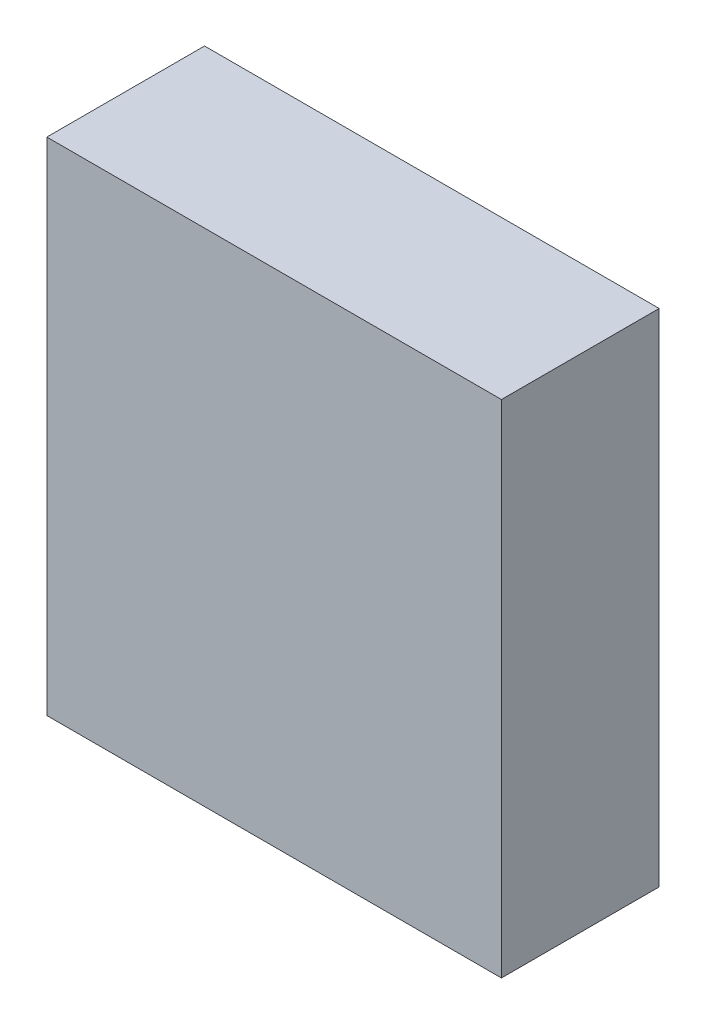
ISO-10303-21;
HEADER;
FILE_DESCRIPTION(('STEP AP214'),'2;1');
FILE_NAME('part.step','',(''),(''),'','','');
FILE_SCHEMA(('AUTOMOTIVE_DESIGN { 1 0 10303 214 1 1 1 1 }'));
ENDSEC;
DATA;
#1=APPLICATION_CONTEXT('core data for automotive mechanical design processes');
#2=APPLICATION_PROTOCOL_DEFINITION('international standard','automotive_design',2000,#1);
#3=PRODUCT_CONTEXT('',#1,'mechanical');
#4=PRODUCT('Part','Part','',(#3));
#5=PRODUCT_RELATED_PRODUCT_CATEGORY('part','',(#4));
#6=PRODUCT_DEFINITION_FORMATION('','',#4);
#7=PRODUCT_DEFINITION_CONTEXT('part definition',#1,'design');
#8=PRODUCT_DEFINITION('design','',#6,#7);
#9=PRODUCT_DEFINITION_SHAPE('','',#8);
#10=(LENGTH_UNIT() NAMED_UNIT(*) SI_UNIT(.MILLI.,.METRE.));
#11=(NAMED_UNIT(*) PLANE_ANGLE_UNIT() SI_UNIT($,.RADIAN.));
#12=(NAMED_UNIT(*) SI_UNIT($,.STERADIAN.) SOLID_ANGLE_UNIT());
#13=UNCERTAINTY_MEASURE_WITH_UNIT(LENGTH_MEASURE(1.E-05),#10,'distance_accuracy_value','');
#14=(GEOMETRIC_REPRESENTATION_CONTEXT(3) GLOBAL_UNCERTAINTY_ASSIGNED_CONTEXT((#13)) GLOBAL_UNIT_ASSIGNED_CONTEXT((#10,
#11,#12)) REPRESENTATION_CONTEXT('',''));
#15=CARTESIAN_POINT('',(0.,0.,0.));
#16=DIRECTION('',(0.,0.,1.));
#17=DIRECTION('',(1.,0.,0.));
#18=AXIS2_PLACEMENT_3D('',#15,#16,#17);
#19=CARTESIAN_POINT('',(-2.450018512399,2.7000019252131,0.));
#20=DIRECTION('',(-1.,8.74227765734759E-08,0.));
#21=DIRECTION('',(-8.74227765734759E-08,-1.,0.));
#22=AXIS2_PLACEMENT_3D('',#19,#20,#21);
#23=PLANE('',#22);
#24=DIRECTION('',(-8.74227765512293E-08,-0.999999999999996,0.));
#25=VECTOR('',#24,1.);
#26=CARTESIAN_POINT('',(-2.450018512399,2.7000019252131,0.));
#27=LINE('',#26,#25);
#28=CARTESIAN_POINT('',(-2.450018512399,2.7000019252131,0.));
#29=VERTEX_POINT('',#28);
#30=CARTESIAN_POINT('',(-2.45001898448146,-2.69999197127127,0.));
#31=VERTEX_POINT('',#30);
#32=EDGE_CURVE('E11',#29,#31,#27,.T.);
#33=ORIENTED_EDGE('',*,*,#32,.T.);
#34=DIRECTION('',(0.,0.,1.));
#35=VECTOR('',#34,1.);
#36=CARTESIAN_POINT('',(-2.45001898448146,-2.69999197127127,0.));
#37=LINE('',#36,#35);
#38=CARTESIAN_POINT('',(-2.45001898448146,-2.69999197127127,1.6999990940094));
#39=VERTEX_POINT('',#38);
#40=EDGE_CURVE('E88',#31,#39,#37,.T.);
#41=ORIENTED_EDGE('',*,*,#40,.T.);
#42=DIRECTION('',(-8.74227765512293E-08,-0.999999999999996,0.));
#43=VECTOR('',#42,1.);
#44=CARTESIAN_POINT('',(-2.450018512399,2.7000019252131,1.6999990940094));
#45=LINE('',#44,#43);
#46=CARTESIAN_POINT('',(-2.450018512399,2.7000019252131,1.6999990940094));
#47=VERTEX_POINT('',#46);
#48=EDGE_CURVE('E83',#47,#39,#45,.T.);
#49=ORIENTED_EDGE('',*,*,#48,.F.);
#50=DIRECTION('',(0.,0.,1.));
#51=VECTOR('',#50,1.);
#52=CARTESIAN_POINT('',(-2.450018512399,2.7000019252131,0.));
#53=LINE('',#52,#51);
#54=EDGE_CURVE('E72',#29,#47,#53,.T.);
#55=ORIENTED_EDGE('',*,*,#54,.F.);
#56=EDGE_LOOP('',(#33,#41,#49,#55));
#57=FACE_BOUND('',#56,.T.);
#58=ADVANCED_FACE('F17',(#57),#23,.T.);
#59=CARTESIAN_POINT('',(-2.45001898448146,-2.69999197127127,0.));
#60=DIRECTION('',(-8.74227765734759E-08,-1.,0.));
#61=DIRECTION('',(1.,-8.74227765734759E-08,0.));
#62=AXIS2_PLACEMENT_3D('',#59,#60,#61);
#63=PLANE('',#62);
#64=DIRECTION('',(0.999999999999996,-8.74227765649347E-08,0.));
#65=VECTOR('',#64,1.);
#66=CARTESIAN_POINT('',(-2.45001898448146,-2.69999197127127,0.));
#67=LINE('',#66,#65);
#68=CARTESIAN_POINT('',(2.44999017079198,-2.69999239964368,0.));
#69=VERTEX_POINT('',#68);
#70=EDGE_CURVE('E24',#31,#69,#67,.T.);
#71=ORIENTED_EDGE('',*,*,#70,.T.);
#72=DIRECTION('',(0.,0.,1.));
#73=VECTOR('',#72,1.);
#74=CARTESIAN_POINT('',(2.44999017079198,-2.69999239964368,0.));
#75=LINE('',#74,#73);
#76=CARTESIAN_POINT('',(2.44999017079198,-2.69999239964368,1.6999990940094));
#77=VERTEX_POINT('',#76);
#78=EDGE_CURVE('E85',#69,#77,#75,.T.);
#79=ORIENTED_EDGE('',*,*,#78,.T.);
#80=DIRECTION('',(0.999999999999996,-8.74227765649347E-08,0.));
#81=VECTOR('',#80,1.);
#82=CARTESIAN_POINT('',(-2.45001898448146,-2.69999197127127,1.6999990940094));
#83=LINE('',#82,#81);
#84=EDGE_CURVE('E66',#39,#77,#83,.T.);
#85=ORIENTED_EDGE('',*,*,#84,.F.);
#86=ORIENTED_EDGE('',*,*,#40,.F.);
#87=EDGE_LOOP('',(#71,#79,#85,#86));
#88=FACE_BOUND('',#87,.T.);
#89=ADVANCED_FACE('F89',(#88),#63,.T.);
#90=CARTESIAN_POINT('',(2.44999017079198,-2.69999239964368,0.));
#91=DIRECTION('',(1.,-8.74227765734759E-08,0.));
#92=DIRECTION('',(8.74227765734759E-08,1.,0.));
#93=AXIS2_PLACEMENT_3D('',#90,#91,#92);
#94=PLANE('',#93);
#95=DIRECTION('',(8.74227765512293E-08,0.999999999999996,0.));
#96=VECTOR('',#95,1.);
#97=CARTESIAN_POINT('',(2.44999017079198,-2.69999239964368,0.));
#98=LINE('',#97,#96);
#99=CARTESIAN_POINT('',(2.44999064287444,2.7000014968407,0.));
#100=VERTEX_POINT('',#99);
#101=EDGE_CURVE('E62',#69,#100,#98,.T.);
#102=ORIENTED_EDGE('',*,*,#101,.T.);
#103=DIRECTION('',(0.,0.,1.));
#104=VECTOR('',#103,1.);
#105=CARTESIAN_POINT('',(2.44999064287444,2.7000014968407,0.));
#106=LINE('',#105,#104);
#107=CARTESIAN_POINT('',(2.44999064287444,2.7000014968407,1.6999990940094));
#108=VERTEX_POINT('',#107);
#109=EDGE_CURVE('E55',#100,#108,#106,.T.);
#110=ORIENTED_EDGE('',*,*,#109,.T.);
#111=DIRECTION('',(8.74227765512293E-08,0.999999999999996,0.));
#112=VECTOR('',#111,1.);
#113=CARTESIAN_POINT('',(2.44999017079198,-2.69999239964368,1.6999990940094));
#114=LINE('',#113,#112);
#115=EDGE_CURVE('E59',#77,#108,#114,.T.);
#116=ORIENTED_EDGE('',*,*,#115,.F.);
#117=ORIENTED_EDGE('',*,*,#78,.F.);
#118=EDGE_LOOP('',(#102,#110,#116,#117));
#119=FACE_BOUND('',#118,.T.);
#120=ADVANCED_FACE('F57',(#119),#94,.T.);
#121=CARTESIAN_POINT('',(2.44999064287444,2.7000014968407,0.));
#122=DIRECTION('',(8.74227765734759E-08,1.,0.));
#123=DIRECTION('',(-1.,8.74227765734759E-08,0.));
#124=AXIS2_PLACEMENT_3D('',#121,#122,#123);
#125=PLANE('',#124);
#126=DIRECTION('',(-0.999999999999996,8.74227765649347E-08,0.));
#127=VECTOR('',#126,1.);
#128=CARTESIAN_POINT('',(2.44999064287444,2.7000014968407,0.));
#129=LINE('',#128,#127);
#130=EDGE_CURVE('E65',#100,#29,#129,.T.);
#131=ORIENTED_EDGE('',*,*,#130,.T.);
#132=ORIENTED_EDGE('',*,*,#54,.T.);
#133=DIRECTION('',(-0.999999999999996,8.74227765649347E-08,0.));
#134=VECTOR('',#133,1.);
#135=CARTESIAN_POINT('',(2.44999064287444,2.7000014968407,1.6999990940094));
#136=LINE('',#135,#134);
#137=EDGE_CURVE('E70',#108,#47,#136,.T.);
#138=ORIENTED_EDGE('',*,*,#137,.F.);
#139=ORIENTED_EDGE('',*,*,#109,.F.);
#140=EDGE_LOOP('',(#131,#132,#138,#139));
#141=FACE_BOUND('',#140,.T.);
#142=ADVANCED_FACE('F71',(#141),#125,.T.);
#143=CARTESIAN_POINT('',(141.75,74.8249893188477,1.6999990940094));
#144=DIRECTION('',(0.,0.,1.));
#145=DIRECTION('',(-1.,8.74227765734759E-08,0.));
#146=AXIS2_PLACEMENT_3D('',#143,#144,#145);
#147=PLANE('',#146);
#148=ORIENTED_EDGE('',*,*,#48,.T.);
#149=ORIENTED_EDGE('',*,*,#84,.T.);
#150=ORIENTED_EDGE('',*,*,#115,.T.);
#151=ORIENTED_EDGE('',*,*,#137,.T.);
#152=EDGE_LOOP('',(#148,#149,#150,#151));
#153=FACE_BOUND('',#152,.T.);
#154=ADVANCED_FACE('F76',(#153),#147,.T.);
#155=CARTESIAN_POINT('',(141.75,74.8249893188477,0.));
#156=DIRECTION('',(0.,0.,1.));
#157=DIRECTION('',(-1.,8.74227765734759E-08,0.));
#158=AXIS2_PLACEMENT_3D('',#155,#156,#157);
#159=PLANE('',#158);
#160=ORIENTED_EDGE('',*,*,#130,.F.);
#161=ORIENTED_EDGE('',*,*,#101,.F.);
#162=ORIENTED_EDGE('',*,*,#70,.F.);
#163=ORIENTED_EDGE('',*,*,#32,.F.);
#164=EDGE_LOOP('',(#160,#161,#162,#163));
#165=FACE_BOUND('',#164,.T.);
#166=ADVANCED_FACE('F91',(#165),#159,.F.);
#167=CLOSED_SHELL('',(#58,#89,#120,#142,#154,#166));
#168=MANIFOLD_SOLID_BREP('B1',#167);
#169=ADVANCED_BREP_SHAPE_REPRESENTATION('',(#18,#168),#14);
#170=SHAPE_DEFINITION_REPRESENTATION(#9,#169);
ENDSEC;
END-ISO-10303-21;
